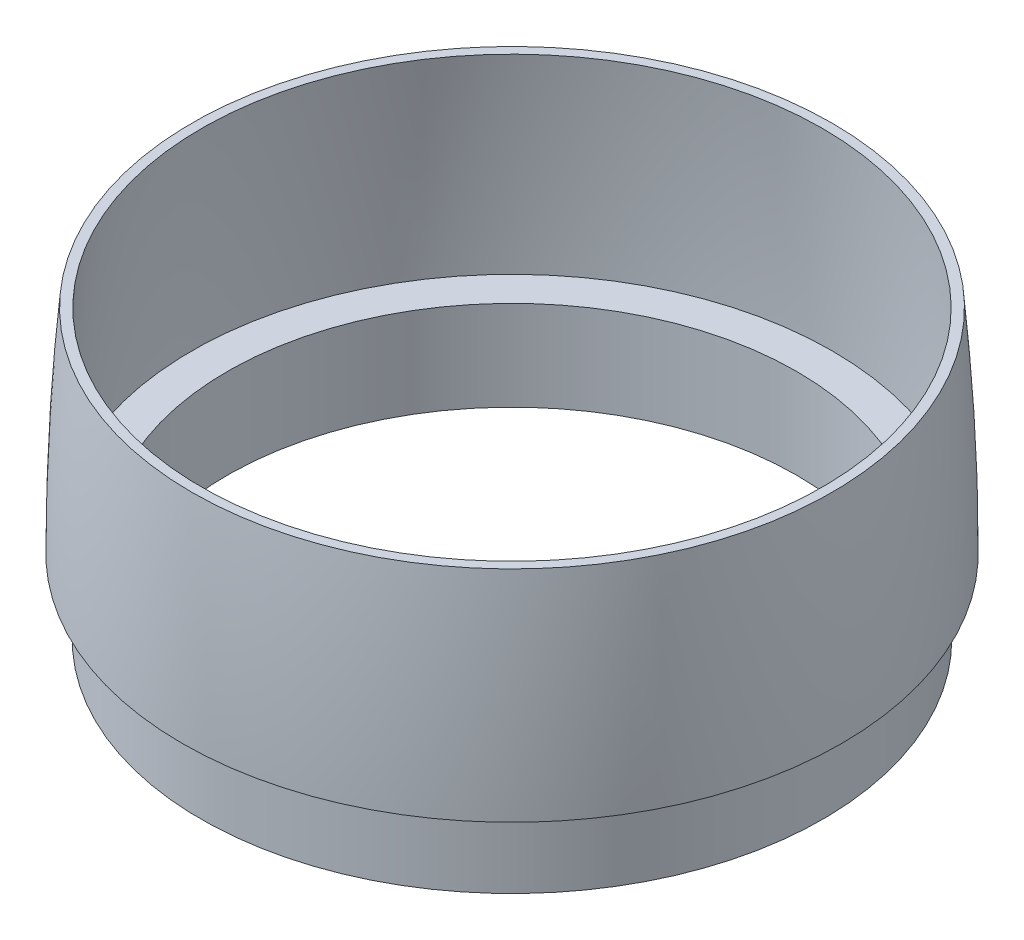
ISO-10303-21;
HEADER;
FILE_DESCRIPTION(('STEP AP214'),'2;1');
FILE_NAME('part.step','',(''),(''),'','','');
FILE_SCHEMA(('AUTOMOTIVE_DESIGN { 1 0 10303 214 1 1 1 1 }'));
ENDSEC;
DATA;
#1=APPLICATION_CONTEXT('core data for automotive mechanical design processes');
#2=APPLICATION_PROTOCOL_DEFINITION('international standard','automotive_design',2000,#1);
#3=PRODUCT_CONTEXT('',#1,'mechanical');
#4=PRODUCT('Part','Part','',(#3));
#5=PRODUCT_RELATED_PRODUCT_CATEGORY('part','',(#4));
#6=PRODUCT_DEFINITION_FORMATION('','',#4);
#7=PRODUCT_DEFINITION_CONTEXT('part definition',#1,'design');
#8=PRODUCT_DEFINITION('design','',#6,#7);
#9=PRODUCT_DEFINITION_SHAPE('','',#8);
#10=(LENGTH_UNIT() NAMED_UNIT(*) SI_UNIT(.MILLI.,.METRE.));
#11=(NAMED_UNIT(*) PLANE_ANGLE_UNIT() SI_UNIT($,.RADIAN.));
#12=(NAMED_UNIT(*) SI_UNIT($,.STERADIAN.) SOLID_ANGLE_UNIT());
#13=UNCERTAINTY_MEASURE_WITH_UNIT(LENGTH_MEASURE(1.E-05),#10,'distance_accuracy_value','');
#14=(GEOMETRIC_REPRESENTATION_CONTEXT(3) GLOBAL_UNCERTAINTY_ASSIGNED_CONTEXT((#13)) GLOBAL_UNIT_ASSIGNED_CONTEXT((#10,
#11,#12)) REPRESENTATION_CONTEXT('',''));
#15=CARTESIAN_POINT('',(0.,0.,0.));
#16=DIRECTION('',(0.,0.,1.));
#17=DIRECTION('',(1.,0.,0.));
#18=AXIS2_PLACEMENT_3D('',#15,#16,#17);
#19=CARTESIAN_POINT('',(44.,0.,0.));
#20=CARTESIAN_POINT('',(44.,82.4403387855606,0.));
#21=CARTESIAN_POINT('',(10.3770076821126,150.,0.));
#22=CARTESIAN_POINT('',(0.,150.,0.));
#23=B_SPLINE_CURVE_WITH_KNOTS('',3,(#19,#20,#21,#22),.UNSPECIFIED.,.F.,.F.,(4,4),(0.,1.),.UNSPECIFIED.);
#24=CARTESIAN_POINT('',(0.,0.,0.));
#25=DIRECTION('',(0.,-1.,0.));
#26=AXIS1_PLACEMENT('',#24,#25);
#27=SURFACE_OF_REVOLUTION('',#23,#26);
#28=CARTESIAN_POINT('',(0.,0.,0.));
#29=DIRECTION('',(0.,-1.,0.));
#30=DIRECTION('',(0.,0.,-1.));
#31=AXIS2_PLACEMENT_3D('',#28,#29,#30);
#32=CIRCLE('',#31,44.);
#33=CARTESIAN_POINT('',(0.,0.,-44.));
#34=VERTEX_POINT('',#33);
#35=EDGE_CURVE('E73',#34,#34,#32,.T.);
#36=ORIENTED_EDGE('',*,*,#35,.F.);
#37=EDGE_LOOP('',(#36));
#38=FACE_BOUND('',#37,.T.);
#39=CARTESIAN_POINT('',(0.,28.3645674336217,0.));
#40=DIRECTION('',(0.,-1.,0.));
#41=DIRECTION('',(0.,0.,-1.));
#42=AXIS2_PLACEMENT_3D('',#39,#40,#41);
#43=CIRCLE('',#42,42.6990733766283);
#44=CARTESIAN_POINT('',(0.,28.3645674336217,-42.6990733766283));
#45=VERTEX_POINT('',#44);
#46=EDGE_CURVE('E77',#45,#45,#43,.T.);
#47=ORIENTED_EDGE('',*,*,#46,.T.);
#48=EDGE_LOOP('',(#47));
#49=FACE_BOUND('',#48,.T.);
#50=ADVANCED_FACE('F45',(#38,#49),#27,.F.);
#51=CARTESIAN_POINT('',(0.,148.75,0.));
#52=CARTESIAN_POINT('',(0.090206504262265,148.75,0.));
#53=CARTESIAN_POINT('',(0.249616767939743,148.734406442624,0.));
#54=CARTESIAN_POINT('',(0.725504974699749,148.610456702779,0.));
#55=CARTESIAN_POINT('',(1.49029033197682,148.236213716884,0.));
#56=CARTESIAN_POINT('',(2.62686531214892,147.39318857306,0.));
#57=CARTESIAN_POINT('',(4.34687501235832,145.755340422846,0.));
#58=CARTESIAN_POINT('',(6.80055603606863,142.780522869829,0.));
#59=CARTESIAN_POINT('',(10.0757217135267,137.836599335113,0.));
#60=CARTESIAN_POINT('',(13.580729048229,131.610663537768,0.));
#61=CARTESIAN_POINT('',(18.4389518717172,121.712395255757,0.));
#62=CARTESIAN_POINT('',(24.6432043348088,106.547112323933,0.));
#63=CARTESIAN_POINT('',(31.6298796132884,84.5066887404101,0.));
#64=CARTESIAN_POINT('',(36.5207884433067,63.4517067542714,0.));
#65=CARTESIAN_POINT('',(39.5465366935332,45.3006496110411,0.));
#66=CARTESIAN_POINT('',(41.29053512436,31.1127238209809,0.));
#67=CARTESIAN_POINT('',(42.2380192092032,18.8660882193737,0.));
#68=CARTESIAN_POINT('',(42.638922690434,9.17805186741099,0.));
#69=CARTESIAN_POINT('',(42.7282447187551,4.29416771148664,0.));
#70=CARTESIAN_POINT('',(42.7450569494336,1.75029101127949,0.));
#71=CARTESIAN_POINT('',(42.7466443691757,1.43652369943591,0.));
#72=CARTESIAN_POINT('',(42.7474153372356,1.24999999999997,0.));
#73=B_SPLINE_CURVE_WITH_KNOTS('',3,(#51,#52,#53,#54,#55,#56,#57,#58,#59,#60,#61,#62,#63,#64,#65,
#66,#67,#68,#69,#70,#71,#72),.UNSPECIFIED.,.F.,.F.,(4,1,1,1,1,1,1,1,1,1,1,1,1,1,1,1,1,1,1,4),
(0.,0.0155456291243303,0.0310912582486605,0.062182516497321,0.0932737747459815,
0.124365032994642,0.186547549491963,0.248730065989284,0.310912582486605,0.373095098983926,
0.497460131978568,0.62182516497321,0.746190197967852,0.808372714465173,0.870555230962494,
0.932737747459815,0.963829005708476,0.991104807340254,0.992630989987006,0.994920263957136),.UNSPECIFIED.);
#74=CARTESIAN_POINT('',(0.,0.,0.));
#75=DIRECTION('',(0.,-1.,0.));
#76=AXIS1_PLACEMENT('',#74,#75);
#77=SURFACE_OF_REVOLUTION('',#73,#76);
#78=CARTESIAN_POINT('',(0.,1.99999999997396,0.));
#79=DIRECTION('',(0.,-1.,0.));
#80=DIRECTION('',(0.,0.,-1.));
#81=AXIS2_PLACEMENT_3D('',#78,#79,#80);
#82=CIRCLE('',#81,42.7433872944777);
#83=CARTESIAN_POINT('',(0.,1.99999999997396,-42.7433872944777));
#84=VERTEX_POINT('',#83);
#85=EDGE_CURVE('E10',#84,#84,#82,.T.);
#86=ORIENTED_EDGE('',*,*,#85,.T.);
#87=EDGE_LOOP('',(#86));
#88=FACE_BOUND('',#87,.T.);
#89=CARTESIAN_POINT('',(0.,28.3645674336217,0.));
#90=DIRECTION('',(0.,-1.,0.));
#91=DIRECTION('',(0.,0.,-1.));
#92=AXIS2_PLACEMENT_3D('',#89,#90,#91);
#93=CIRCLE('',#92,41.443843549576);
#94=CARTESIAN_POINT('',(0.,28.3645674336217,-41.443843549576));
#95=VERTEX_POINT('',#94);
#96=EDGE_CURVE('E49',#95,#95,#93,.F.);
#97=ORIENTED_EDGE('',*,*,#96,.T.);
#98=EDGE_LOOP('',(#97));
#99=FACE_BOUND('',#98,.T.);
#100=ADVANCED_FACE('F88',(#88,#99),#77,.F.);
#101=CARTESIAN_POINT('',(38.,1.99999999998698,0.));
#102=DIRECTION('',(0.,1.,0.));
#103=DIRECTION('',(0.,0.,1.));
#104=AXIS2_PLACEMENT_3D('',#101,#102,#103);
#105=PLANE('',#104);
#106=CARTESIAN_POINT('',(0.,2.,0.));
#107=DIRECTION('',(0.,-1.,0.));
#108=DIRECTION('',(0.,0.,-1.));
#109=AXIS2_PLACEMENT_3D('',#106,#107,#108);
#110=CIRCLE('',#109,38.);
#111=CARTESIAN_POINT('',(0.,2.,-38.));
#112=VERTEX_POINT('',#111);
#113=EDGE_CURVE('E54',#112,#112,#110,.T.);
#114=ORIENTED_EDGE('',*,*,#113,.T.);
#115=EDGE_LOOP('',(#114));
#116=FACE_BOUND('',#115,.T.);
#117=ORIENTED_EDGE('',*,*,#85,.F.);
#118=EDGE_LOOP('',(#117));
#119=FACE_BOUND('',#118,.T.);
#120=ADVANCED_FACE('F91',(#116,#119),#105,.T.);
#121=CARTESIAN_POINT('',(0.,0.,0.));
#122=DIRECTION('',(0.,-1.,0.));
#123=DIRECTION('',(0.,0.,-1.));
#124=AXIS2_PLACEMENT_3D('',#121,#122,#123);
#125=CYLINDRICAL_SURFACE('',#124,38.);
#126=CARTESIAN_POINT('',(0.,-10.,0.));
#127=DIRECTION('',(0.,-1.,0.));
#128=DIRECTION('',(0.,0.,-1.));
#129=AXIS2_PLACEMENT_3D('',#126,#127,#128);
#130=CIRCLE('',#129,38.);
#131=CARTESIAN_POINT('',(0.,-10.,-38.));
#132=VERTEX_POINT('',#131);
#133=EDGE_CURVE('E59',#132,#132,#130,.T.);
#134=ORIENTED_EDGE('',*,*,#133,.T.);
#135=EDGE_LOOP('',(#134));
#136=FACE_BOUND('',#135,.T.);
#137=ORIENTED_EDGE('',*,*,#113,.F.);
#138=EDGE_LOOP('',(#137));
#139=FACE_BOUND('',#138,.T.);
#140=ADVANCED_FACE('F94',(#136,#139),#125,.F.);
#141=CARTESIAN_POINT('',(41.5,-10.,0.));
#142=DIRECTION('',(0.,-1.,0.));
#143=DIRECTION('',(0.,0.,-1.));
#144=AXIS2_PLACEMENT_3D('',#141,#142,#143);
#145=PLANE('',#144);
#146=CARTESIAN_POINT('',(0.,-10.,0.));
#147=DIRECTION('',(0.,-1.,0.));
#148=DIRECTION('',(0.,0.,-1.));
#149=AXIS2_PLACEMENT_3D('',#146,#147,#148);
#150=CIRCLE('',#149,41.5);
#151=CARTESIAN_POINT('',(0.,-10.,-41.5));
#152=VERTEX_POINT('',#151);
#153=EDGE_CURVE('E65',#152,#152,#150,.T.);
#154=ORIENTED_EDGE('',*,*,#153,.T.);
#155=EDGE_LOOP('',(#154));
#156=FACE_BOUND('',#155,.T.);
#157=ORIENTED_EDGE('',*,*,#133,.F.);
#158=EDGE_LOOP('',(#157));
#159=FACE_BOUND('',#158,.T.);
#160=ADVANCED_FACE('F98',(#156,#159),#145,.T.);
#161=CARTESIAN_POINT('',(0.,0.,0.));
#162=DIRECTION('',(0.,-1.,0.));
#163=DIRECTION('',(0.,0.,-1.));
#164=AXIS2_PLACEMENT_3D('',#161,#162,#163);
#165=CYLINDRICAL_SURFACE('',#164,41.5);
#166=CARTESIAN_POINT('',(0.,0.,0.));
#167=DIRECTION('',(0.,-1.,0.));
#168=DIRECTION('',(0.,0.,-1.));
#169=AXIS2_PLACEMENT_3D('',#166,#167,#168);
#170=CIRCLE('',#169,41.5);
#171=CARTESIAN_POINT('',(0.,0.,-41.5));
#172=VERTEX_POINT('',#171);
#173=EDGE_CURVE('E69',#172,#172,#170,.T.);
#174=ORIENTED_EDGE('',*,*,#173,.T.);
#175=EDGE_LOOP('',(#174));
#176=FACE_BOUND('',#175,.T.);
#177=ORIENTED_EDGE('',*,*,#153,.F.);
#178=EDGE_LOOP('',(#177));
#179=FACE_BOUND('',#178,.T.);
#180=ADVANCED_FACE('F102',(#176,#179),#165,.T.);
#181=CARTESIAN_POINT('',(41.5,0.,0.));
#182=DIRECTION('',(0.,-1.,0.));
#183=DIRECTION('',(0.,0.,-1.));
#184=AXIS2_PLACEMENT_3D('',#181,#182,#183);
#185=PLANE('',#184);
#186=ORIENTED_EDGE('',*,*,#35,.T.);
#187=EDGE_LOOP('',(#186));
#188=FACE_BOUND('',#187,.T.);
#189=ORIENTED_EDGE('',*,*,#173,.F.);
#190=EDGE_LOOP('',(#189));
#191=FACE_BOUND('',#190,.T.);
#192=ADVANCED_FACE('F106',(#188,#191),#185,.T.);
#193=CARTESIAN_POINT('',(-135.536837080169,28.3645674336217,99.));
#194=DIRECTION('',(0.,1.,0.));
#195=DIRECTION('',(0.,0.,1.));
#196=AXIS2_PLACEMENT_3D('',#193,#194,#195);
#197=PLANE('',#196);
#198=ORIENTED_EDGE('',*,*,#46,.F.);
#199=EDGE_LOOP('',(#198));
#200=FACE_BOUND('',#199,.T.);
#201=ORIENTED_EDGE('',*,*,#96,.F.);
#202=EDGE_LOOP('',(#201));
#203=FACE_BOUND('',#202,.T.);
#204=ADVANCED_FACE('F110',(#200,#203),#197,.T.);
#205=CLOSED_SHELL('',(#50,#100,#120,#140,#160,#180,#192,#204));
#206=MANIFOLD_SOLID_BREP('B2',#205);
#207=ADVANCED_BREP_SHAPE_REPRESENTATION('',(#18,#206),#14);
#208=SHAPE_DEFINITION_REPRESENTATION(#9,#207);
ENDSEC;
END-ISO-10303-21;
